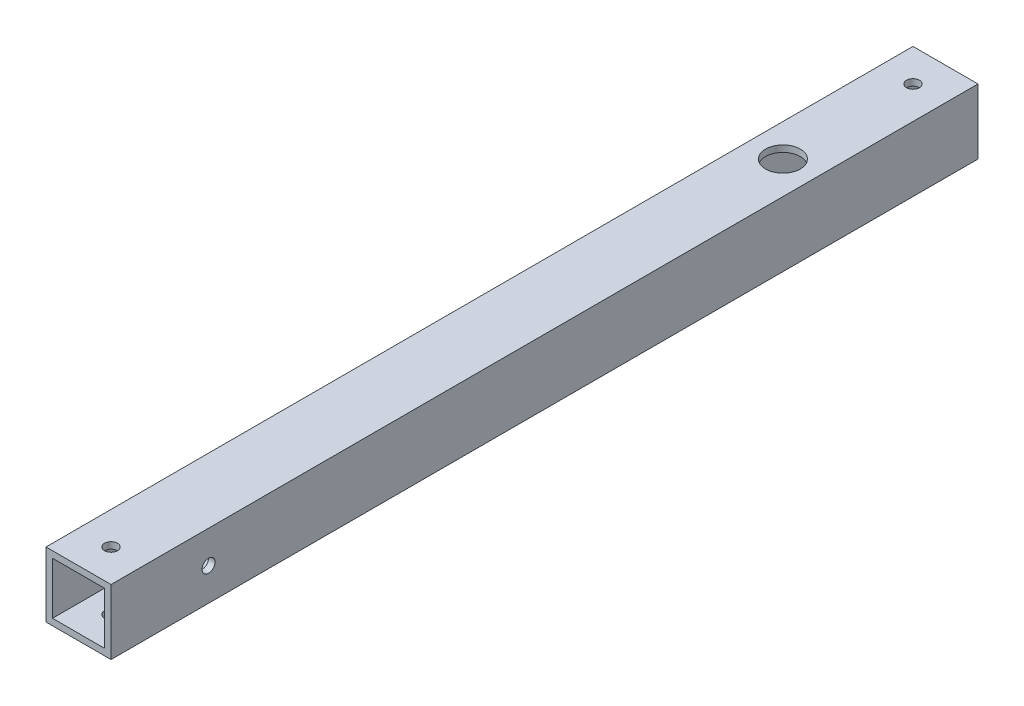
ISO-10303-21;
HEADER;
FILE_DESCRIPTION(('STEP AP214'),'2;1');
FILE_NAME('part.step','',(''),(''),'','','');
FILE_SCHEMA(('AUTOMOTIVE_DESIGN { 1 0 10303 214 1 1 1 1 }'));
ENDSEC;
DATA;
#1=APPLICATION_CONTEXT('core data for automotive mechanical design processes');
#2=APPLICATION_PROTOCOL_DEFINITION('international standard','automotive_design',2000,#1);
#3=PRODUCT_CONTEXT('',#1,'mechanical');
#4=PRODUCT('Part','Part','',(#3));
#5=PRODUCT_RELATED_PRODUCT_CATEGORY('part','',(#4));
#6=PRODUCT_DEFINITION_FORMATION('','',#4);
#7=PRODUCT_DEFINITION_CONTEXT('part definition',#1,'design');
#8=PRODUCT_DEFINITION('design','',#6,#7);
#9=PRODUCT_DEFINITION_SHAPE('','',#8);
#10=(LENGTH_UNIT() NAMED_UNIT(*) SI_UNIT(.MILLI.,.METRE.));
#11=(NAMED_UNIT(*) PLANE_ANGLE_UNIT() SI_UNIT($,.RADIAN.));
#12=(NAMED_UNIT(*) SI_UNIT($,.STERADIAN.) SOLID_ANGLE_UNIT());
#13=UNCERTAINTY_MEASURE_WITH_UNIT(LENGTH_MEASURE(1.E-05),#10,'distance_accuracy_value','');
#14=(GEOMETRIC_REPRESENTATION_CONTEXT(3) GLOBAL_UNCERTAINTY_ASSIGNED_CONTEXT((#13)) GLOBAL_UNIT_ASSIGNED_CONTEXT((#10,
#11,#12)) REPRESENTATION_CONTEXT('',''));
#15=CARTESIAN_POINT('',(0.,0.,0.));
#16=DIRECTION('',(0.,0.,1.));
#17=DIRECTION('',(1.,0.,0.));
#18=AXIS2_PLACEMENT_3D('',#15,#16,#17);
#19=CARTESIAN_POINT('',(0.,0.,200.));
#20=DIRECTION('',(0.,0.,1.));
#21=DIRECTION('',(1.,0.,0.));
#22=AXIS2_PLACEMENT_3D('',#19,#20,#21);
#23=PLANE('',#22);
#24=DIRECTION('',(0.,-1.,0.));
#25=VECTOR('',#24,1.);
#26=CARTESIAN_POINT('',(-7.01008414074451,7.73262608579252,200.));
#27=LINE('',#26,#25);
#28=CARTESIAN_POINT('',(-7.01008414074451,7.73262608579252,200.));
#29=VERTEX_POINT('',#28);
#30=CARTESIAN_POINT('',(-7.01008414074451,-7.26737391420748,200.));
#31=VERTEX_POINT('',#30);
#32=EDGE_CURVE('E138',#29,#31,#27,.T.);
#33=ORIENTED_EDGE('',*,*,#32,.T.);
#34=DIRECTION('',(1.,0.,0.));
#35=VECTOR('',#34,1.);
#36=CARTESIAN_POINT('',(-7.01008414074451,-7.26737391420748,200.));
#37=LINE('',#36,#35);
#38=CARTESIAN_POINT('',(7.98991585925548,-7.26737391420748,200.));
#39=VERTEX_POINT('',#38);
#40=EDGE_CURVE('E141',#31,#39,#37,.T.);
#41=ORIENTED_EDGE('',*,*,#40,.T.);
#42=DIRECTION('',(0.,1.,0.));
#43=VECTOR('',#42,1.);
#44=CARTESIAN_POINT('',(7.98991585925549,7.73262608579252,200.));
#45=LINE('',#44,#43);
#46=CARTESIAN_POINT('',(7.98991585925549,7.73262608579252,200.));
#47=VERTEX_POINT('',#46);
#48=EDGE_CURVE('E144',#39,#47,#45,.T.);
#49=ORIENTED_EDGE('',*,*,#48,.T.);
#50=DIRECTION('',(-1.,0.,0.));
#51=VECTOR('',#50,1.);
#52=CARTESIAN_POINT('',(-7.01008414074451,7.73262608579252,200.));
#53=LINE('',#52,#51);
#54=EDGE_CURVE('E146',#47,#29,#53,.T.);
#55=ORIENTED_EDGE('',*,*,#54,.T.);
#56=EDGE_LOOP('',(#33,#41,#49,#55));
#57=FACE_BOUND('',#56,.T.);
#58=DIRECTION('',(1.,0.,0.));
#59=VECTOR('',#58,1.);
#60=CARTESIAN_POINT('',(-5.51008414074451,-5.76737391420748,200.));
#61=LINE('',#60,#59);
#62=CARTESIAN_POINT('',(-5.51008414074451,-5.76737391420748,200.));
#63=VERTEX_POINT('',#62);
#64=CARTESIAN_POINT('',(6.48991585925549,-5.76737391420748,200.));
#65=VERTEX_POINT('',#64);
#66=EDGE_CURVE('E108',#63,#65,#61,.T.);
#67=ORIENTED_EDGE('',*,*,#66,.F.);
#68=DIRECTION('',(0.,-1.,0.));
#69=VECTOR('',#68,1.);
#70=CARTESIAN_POINT('',(-5.51008414074451,6.23262608579252,200.));
#71=LINE('',#70,#69);
#72=CARTESIAN_POINT('',(-5.51008414074451,6.23262608579252,200.));
#73=VERTEX_POINT('',#72);
#74=EDGE_CURVE('E100',#73,#63,#71,.T.);
#75=ORIENTED_EDGE('',*,*,#74,.F.);
#76=DIRECTION('',(-1.,0.,0.));
#77=VECTOR('',#76,1.);
#78=CARTESIAN_POINT('',(-5.51008414074451,6.23262608579252,200.));
#79=LINE('',#78,#77);
#80=CARTESIAN_POINT('',(6.48991585925549,6.23262608579252,200.));
#81=VERTEX_POINT('',#80);
#82=EDGE_CURVE('E122',#81,#73,#79,.T.);
#83=ORIENTED_EDGE('',*,*,#82,.F.);
#84=DIRECTION('',(0.,1.,0.));
#85=VECTOR('',#84,1.);
#86=CARTESIAN_POINT('',(6.48991585925549,6.23262608579252,200.));
#87=LINE('',#86,#85);
#88=EDGE_CURVE('E120',#65,#81,#87,.T.);
#89=ORIENTED_EDGE('',*,*,#88,.F.);
#90=EDGE_LOOP('',(#67,#75,#83,#89));
#91=FACE_BOUND('',#90,.T.);
#92=ADVANCED_FACE('F33',(#57,#91),#23,.T.);
#93=CARTESIAN_POINT('',(0.,0.,0.));
#94=DIRECTION('',(0.,0.,1.));
#95=DIRECTION('',(1.,0.,0.));
#96=AXIS2_PLACEMENT_3D('',#93,#94,#95);
#97=PLANE('',#96);
#98=DIRECTION('',(0.,-1.,0.));
#99=VECTOR('',#98,1.);
#100=CARTESIAN_POINT('',(-7.01008414074451,7.73262608579252,0.));
#101=LINE('',#100,#99);
#102=CARTESIAN_POINT('',(-7.01008414074451,7.73262608579252,0.));
#103=VERTEX_POINT('',#102);
#104=CARTESIAN_POINT('',(-7.01008414074451,-7.26737391420748,0.));
#105=VERTEX_POINT('',#104);
#106=EDGE_CURVE('E116',#103,#105,#101,.T.);
#107=ORIENTED_EDGE('',*,*,#106,.F.);
#108=DIRECTION('',(-1.,0.,0.));
#109=VECTOR('',#108,1.);
#110=CARTESIAN_POINT('',(-7.01008414074451,7.73262608579252,0.));
#111=LINE('',#110,#109);
#112=CARTESIAN_POINT('',(7.98991585925549,7.73262608579252,0.));
#113=VERTEX_POINT('',#112);
#114=EDGE_CURVE('E142',#113,#103,#111,.T.);
#115=ORIENTED_EDGE('',*,*,#114,.F.);
#116=DIRECTION('',(0.,1.,0.));
#117=VECTOR('',#116,1.);
#118=CARTESIAN_POINT('',(7.98991585925549,7.73262608579252,0.));
#119=LINE('',#118,#117);
#120=CARTESIAN_POINT('',(7.98991585925548,-7.26737391420748,0.));
#121=VERTEX_POINT('',#120);
#122=EDGE_CURVE('E153',#121,#113,#119,.T.);
#123=ORIENTED_EDGE('',*,*,#122,.F.);
#124=DIRECTION('',(1.,0.,0.));
#125=VECTOR('',#124,1.);
#126=CARTESIAN_POINT('',(-7.01008414074451,-7.26737391420748,0.));
#127=LINE('',#126,#125);
#128=EDGE_CURVE('E151',#105,#121,#127,.T.);
#129=ORIENTED_EDGE('',*,*,#128,.F.);
#130=EDGE_LOOP('',(#107,#115,#123,#129));
#131=FACE_BOUND('',#130,.T.);
#132=DIRECTION('',(0.,-1.,0.));
#133=VECTOR('',#132,1.);
#134=CARTESIAN_POINT('',(-5.51008414074451,6.23262608579252,0.));
#135=LINE('',#134,#133);
#136=CARTESIAN_POINT('',(-5.51008414074451,6.23262608579252,0.));
#137=VERTEX_POINT('',#136);
#138=CARTESIAN_POINT('',(-5.51008414074451,-5.76737391420748,0.));
#139=VERTEX_POINT('',#138);
#140=EDGE_CURVE('E58',#137,#139,#135,.T.);
#141=ORIENTED_EDGE('',*,*,#140,.T.);
#142=DIRECTION('',(1.,0.,0.));
#143=VECTOR('',#142,1.);
#144=CARTESIAN_POINT('',(-5.51008414074451,-5.76737391420748,0.));
#145=LINE('',#144,#143);
#146=CARTESIAN_POINT('',(6.48991585925549,-5.76737391420748,0.));
#147=VERTEX_POINT('',#146);
#148=EDGE_CURVE('E115',#139,#147,#145,.T.);
#149=ORIENTED_EDGE('',*,*,#148,.T.);
#150=DIRECTION('',(0.,1.,0.));
#151=VECTOR('',#150,1.);
#152=CARTESIAN_POINT('',(6.48991585925549,6.23262608579252,0.));
#153=LINE('',#152,#151);
#154=CARTESIAN_POINT('',(6.48991585925549,6.23262608579252,0.));
#155=VERTEX_POINT('',#154);
#156=EDGE_CURVE('E130',#147,#155,#153,.T.);
#157=ORIENTED_EDGE('',*,*,#156,.T.);
#158=DIRECTION('',(-1.,0.,0.));
#159=VECTOR('',#158,1.);
#160=CARTESIAN_POINT('',(-5.51008414074451,6.23262608579252,0.));
#161=LINE('',#160,#159);
#162=EDGE_CURVE('E109',#155,#137,#161,.T.);
#163=ORIENTED_EDGE('',*,*,#162,.T.);
#164=EDGE_LOOP('',(#141,#149,#157,#163));
#165=FACE_BOUND('',#164,.T.);
#166=ADVANCED_FACE('F231',(#131,#165),#97,.F.);
#167=CARTESIAN_POINT('',(-7.01008414074451,7.73262608579252,200.));
#168=DIRECTION('',(1.,0.,0.));
#169=DIRECTION('',(0.,1.,0.));
#170=AXIS2_PLACEMENT_3D('',#167,#168,#169);
#171=PLANE('',#170);
#172=CARTESIAN_POINT('',(-7.01008414074451,0.232626085792522,177.5));
#173=DIRECTION('',(1.,0.,0.));
#174=DIRECTION('',(0.,1.,0.));
#175=AXIS2_PLACEMENT_3D('',#172,#173,#174);
#176=CIRCLE('',#175,1.5);
#177=CARTESIAN_POINT('',(-7.01008414074451,1.73262608579252,177.5));
#178=VERTEX_POINT('',#177);
#179=EDGE_CURVE('E171',#178,#178,#176,.T.);
#180=ORIENTED_EDGE('',*,*,#179,.T.);
#181=EDGE_LOOP('',(#180));
#182=FACE_BOUND('',#181,.T.);
#183=ORIENTED_EDGE('',*,*,#106,.T.);
#184=DIRECTION('',(0.,0.,-1.));
#185=VECTOR('',#184,1.);
#186=CARTESIAN_POINT('',(-7.01008414074451,-7.26737391420748,200.));
#187=LINE('',#186,#185);
#188=EDGE_CURVE('E11',#31,#105,#187,.T.);
#189=ORIENTED_EDGE('',*,*,#188,.F.);
#190=ORIENTED_EDGE('',*,*,#32,.F.);
#191=DIRECTION('',(0.,0.,-1.));
#192=VECTOR('',#191,1.);
#193=CARTESIAN_POINT('',(-7.01008414074451,7.73262608579252,200.));
#194=LINE('',#193,#192);
#195=EDGE_CURVE('E148',#29,#103,#194,.T.);
#196=ORIENTED_EDGE('',*,*,#195,.T.);
#197=EDGE_LOOP('',(#183,#189,#190,#196));
#198=FACE_BOUND('',#197,.T.);
#199=ADVANCED_FACE('F35',(#182,#198),#171,.F.);
#200=CARTESIAN_POINT('',(-7.01008414074451,-7.26737391420748,200.));
#201=DIRECTION('',(0.,1.,0.));
#202=DIRECTION('',(0.,0.,1.));
#203=AXIS2_PLACEMENT_3D('',#200,#201,#202);
#204=PLANE('',#203);
#205=CARTESIAN_POINT('',(0.489915859255487,-7.26737391420748,37.5));
#206=DIRECTION('',(0.,-1.,0.));
#207=DIRECTION('',(0.,0.,-1.));
#208=AXIS2_PLACEMENT_3D('',#205,#206,#207);
#209=CIRCLE('',#208,1.5);
#210=CARTESIAN_POINT('',(0.489915859255487,-7.26737391420748,36.));
#211=VERTEX_POINT('',#210);
#212=EDGE_CURVE('E181',#211,#211,#209,.T.);
#213=ORIENTED_EDGE('',*,*,#212,.F.);
#214=EDGE_LOOP('',(#213));
#215=FACE_BOUND('',#214,.T.);
#216=CARTESIAN_POINT('',(0.489915859255487,-7.26737391420748,7.5));
#217=DIRECTION('',(0.,-1.,0.));
#218=DIRECTION('',(0.,0.,-1.));
#219=AXIS2_PLACEMENT_3D('',#216,#217,#218);
#220=CIRCLE('',#219,4.);
#221=CARTESIAN_POINT('',(0.489915859255487,-7.26737391420748,3.5));
#222=VERTEX_POINT('',#221);
#223=EDGE_CURVE('E187',#222,#222,#220,.T.);
#224=ORIENTED_EDGE('',*,*,#223,.F.);
#225=EDGE_LOOP('',(#224));
#226=FACE_BOUND('',#225,.T.);
#227=CARTESIAN_POINT('',(0.489915859255487,-7.26737391420748,192.5));
#228=DIRECTION('',(0.,1.,0.));
#229=DIRECTION('',(0.,0.,1.));
#230=AXIS2_PLACEMENT_3D('',#227,#228,#229);
#231=CIRCLE('',#230,1.5);
#232=CARTESIAN_POINT('',(0.489915859255487,-7.26737391420748,194.));
#233=VERTEX_POINT('',#232);
#234=EDGE_CURVE('E166',#233,#233,#231,.T.);
#235=ORIENTED_EDGE('',*,*,#234,.T.);
#236=EDGE_LOOP('',(#235));
#237=FACE_BOUND('',#236,.T.);
#238=ORIENTED_EDGE('',*,*,#128,.T.);
#239=DIRECTION('',(0.,0.,-1.));
#240=VECTOR('',#239,1.);
#241=CARTESIAN_POINT('',(7.98991585925548,-7.26737391420748,200.));
#242=LINE('',#241,#240);
#243=EDGE_CURVE('E42',#39,#121,#242,.T.);
#244=ORIENTED_EDGE('',*,*,#243,.F.);
#245=ORIENTED_EDGE('',*,*,#40,.F.);
#246=ORIENTED_EDGE('',*,*,#188,.T.);
#247=EDGE_LOOP('',(#238,#244,#245,#246));
#248=FACE_BOUND('',#247,.T.);
#249=ADVANCED_FACE('F245',(#215,#226,#237,#248),#204,.F.);
#250=CARTESIAN_POINT('',(7.98991585925549,7.73262608579252,200.));
#251=DIRECTION('',(-1.,0.,0.));
#252=DIRECTION('',(0.,-1.,0.));
#253=AXIS2_PLACEMENT_3D('',#250,#251,#252);
#254=PLANE('',#253);
#255=CARTESIAN_POINT('',(7.98991585925548,0.232626085792518,177.5));
#256=DIRECTION('',(1.,0.,0.));
#257=DIRECTION('',(0.,1.,0.));
#258=AXIS2_PLACEMENT_3D('',#255,#256,#257);
#259=CIRCLE('',#258,1.5);
#260=CARTESIAN_POINT('',(7.98991585925548,1.73262608579252,177.5));
#261=VERTEX_POINT('',#260);
#262=EDGE_CURVE('E178',#261,#261,#259,.T.);
#263=ORIENTED_EDGE('',*,*,#262,.F.);
#264=EDGE_LOOP('',(#263));
#265=FACE_BOUND('',#264,.T.);
#266=ORIENTED_EDGE('',*,*,#122,.T.);
#267=DIRECTION('',(0.,0.,-1.));
#268=VECTOR('',#267,1.);
#269=CARTESIAN_POINT('',(7.98991585925549,7.73262608579252,200.));
#270=LINE('',#269,#268);
#271=EDGE_CURVE('E158',#47,#113,#270,.T.);
#272=ORIENTED_EDGE('',*,*,#271,.F.);
#273=ORIENTED_EDGE('',*,*,#48,.F.);
#274=ORIENTED_EDGE('',*,*,#243,.T.);
#275=EDGE_LOOP('',(#266,#272,#273,#274));
#276=FACE_BOUND('',#275,.T.);
#277=ADVANCED_FACE('F242',(#265,#276),#254,.F.);
#278=CARTESIAN_POINT('',(-7.01008414074451,7.73262608579252,200.));
#279=DIRECTION('',(0.,-1.,0.));
#280=DIRECTION('',(0.,0.,-1.));
#281=AXIS2_PLACEMENT_3D('',#278,#279,#280);
#282=PLANE('',#281);
#283=CARTESIAN_POINT('',(0.489915859255487,7.73262608579252,7.5));
#284=DIRECTION('',(0.,1.,0.));
#285=DIRECTION('',(0.,0.,1.));
#286=AXIS2_PLACEMENT_3D('',#283,#284,#285);
#287=CIRCLE('',#286,1.5);
#288=CARTESIAN_POINT('',(0.489915859255487,7.73262608579252,9.));
#289=VERTEX_POINT('',#288);
#290=EDGE_CURVE('E176',#289,#289,#287,.T.);
#291=ORIENTED_EDGE('',*,*,#290,.F.);
#292=EDGE_LOOP('',(#291));
#293=FACE_BOUND('',#292,.T.);
#294=CARTESIAN_POINT('',(0.489915859255487,7.73262608579252,37.5));
#295=DIRECTION('',(0.,1.,0.));
#296=DIRECTION('',(0.,0.,1.));
#297=AXIS2_PLACEMENT_3D('',#294,#295,#296);
#298=CIRCLE('',#297,4.);
#299=CARTESIAN_POINT('',(0.489915859255487,7.73262608579252,41.5));
#300=VERTEX_POINT('',#299);
#301=EDGE_CURVE('E185',#300,#300,#298,.T.);
#302=ORIENTED_EDGE('',*,*,#301,.F.);
#303=EDGE_LOOP('',(#302));
#304=FACE_BOUND('',#303,.T.);
#305=CARTESIAN_POINT('',(0.489915859255487,7.73262608579252,192.5));
#306=DIRECTION('',(0.,1.,0.));
#307=DIRECTION('',(0.,0.,1.));
#308=AXIS2_PLACEMENT_3D('',#305,#306,#307);
#309=CIRCLE('',#308,1.5);
#310=CARTESIAN_POINT('',(0.489915859255487,7.73262608579252,194.));
#311=VERTEX_POINT('',#310);
#312=EDGE_CURVE('E204',#311,#311,#309,.T.);
#313=ORIENTED_EDGE('',*,*,#312,.F.);
#314=EDGE_LOOP('',(#313));
#315=FACE_BOUND('',#314,.T.);
#316=ORIENTED_EDGE('',*,*,#114,.T.);
#317=ORIENTED_EDGE('',*,*,#195,.F.);
#318=ORIENTED_EDGE('',*,*,#54,.F.);
#319=ORIENTED_EDGE('',*,*,#271,.T.);
#320=EDGE_LOOP('',(#316,#317,#318,#319));
#321=FACE_BOUND('',#320,.T.);
#322=ADVANCED_FACE('F225',(#293,#304,#315,#321),#282,.F.);
#323=CARTESIAN_POINT('',(-5.51008414074451,6.23262608579252,200.));
#324=DIRECTION('',(1.,0.,0.));
#325=DIRECTION('',(0.,1.,0.));
#326=AXIS2_PLACEMENT_3D('',#323,#324,#325);
#327=PLANE('',#326);
#328=CARTESIAN_POINT('',(-5.51008414074451,0.232626085792522,177.5));
#329=DIRECTION('',(1.,0.,0.));
#330=DIRECTION('',(0.,1.,0.));
#331=AXIS2_PLACEMENT_3D('',#328,#329,#330);
#332=CIRCLE('',#331,1.5);
#333=CARTESIAN_POINT('',(-5.51008414074451,1.73262608579252,177.5));
#334=VERTEX_POINT('',#333);
#335=EDGE_CURVE('E170',#334,#334,#332,.T.);
#336=ORIENTED_EDGE('',*,*,#335,.F.);
#337=EDGE_LOOP('',(#336));
#338=FACE_BOUND('',#337,.T.);
#339=ORIENTED_EDGE('',*,*,#140,.F.);
#340=DIRECTION('',(0.,0.,-1.));
#341=VECTOR('',#340,1.);
#342=CARTESIAN_POINT('',(-5.51008414074451,6.23262608579252,200.));
#343=LINE('',#342,#341);
#344=EDGE_CURVE('E104',#73,#137,#343,.T.);
#345=ORIENTED_EDGE('',*,*,#344,.F.);
#346=ORIENTED_EDGE('',*,*,#74,.T.);
#347=DIRECTION('',(0.,0.,-1.));
#348=VECTOR('',#347,1.);
#349=CARTESIAN_POINT('',(-5.51008414074451,-5.76737391420748,200.));
#350=LINE('',#349,#348);
#351=EDGE_CURVE('E103',#63,#139,#350,.T.);
#352=ORIENTED_EDGE('',*,*,#351,.T.);
#353=EDGE_LOOP('',(#339,#345,#346,#352));
#354=FACE_BOUND('',#353,.T.);
#355=ADVANCED_FACE('F102',(#338,#354),#327,.T.);
#356=CARTESIAN_POINT('',(-5.51008414074451,-5.76737391420748,200.));
#357=DIRECTION('',(0.,1.,0.));
#358=DIRECTION('',(0.,0.,1.));
#359=AXIS2_PLACEMENT_3D('',#356,#357,#358);
#360=PLANE('',#359);
#361=CARTESIAN_POINT('',(0.489915859255487,-5.76737391420748,37.5));
#362=DIRECTION('',(0.,1.,0.));
#363=DIRECTION('',(0.,0.,1.));
#364=AXIS2_PLACEMENT_3D('',#361,#362,#363);
#365=CIRCLE('',#364,1.5);
#366=CARTESIAN_POINT('',(0.489915859255487,-5.76737391420748,39.));
#367=VERTEX_POINT('',#366);
#368=EDGE_CURVE('E37',#367,#367,#365,.T.);
#369=ORIENTED_EDGE('',*,*,#368,.F.);
#370=EDGE_LOOP('',(#369));
#371=FACE_BOUND('',#370,.T.);
#372=CARTESIAN_POINT('',(0.489915859255487,-5.76737391420748,7.5));
#373=DIRECTION('',(0.,1.,0.));
#374=DIRECTION('',(0.,0.,1.));
#375=AXIS2_PLACEMENT_3D('',#372,#373,#374);
#376=CIRCLE('',#375,4.);
#377=CARTESIAN_POINT('',(0.489915859255487,-5.76737391420748,11.5));
#378=VERTEX_POINT('',#377);
#379=EDGE_CURVE('E179',#378,#378,#376,.T.);
#380=ORIENTED_EDGE('',*,*,#379,.F.);
#381=EDGE_LOOP('',(#380));
#382=FACE_BOUND('',#381,.T.);
#383=CARTESIAN_POINT('',(0.489915859255487,-5.76737391420748,192.5));
#384=DIRECTION('',(0.,1.,0.));
#385=DIRECTION('',(0.,0.,1.));
#386=AXIS2_PLACEMENT_3D('',#383,#384,#385);
#387=CIRCLE('',#386,1.5);
#388=CARTESIAN_POINT('',(0.489915859255487,-5.76737391420748,194.));
#389=VERTEX_POINT('',#388);
#390=EDGE_CURVE('E128',#389,#389,#387,.T.);
#391=ORIENTED_EDGE('',*,*,#390,.F.);
#392=EDGE_LOOP('',(#391));
#393=FACE_BOUND('',#392,.T.);
#394=ORIENTED_EDGE('',*,*,#148,.F.);
#395=ORIENTED_EDGE('',*,*,#351,.F.);
#396=ORIENTED_EDGE('',*,*,#66,.T.);
#397=DIRECTION('',(0.,0.,-1.));
#398=VECTOR('',#397,1.);
#399=CARTESIAN_POINT('',(6.48991585925549,-5.76737391420748,200.));
#400=LINE('',#399,#398);
#401=EDGE_CURVE('E117',#65,#147,#400,.T.);
#402=ORIENTED_EDGE('',*,*,#401,.T.);
#403=EDGE_LOOP('',(#394,#395,#396,#402));
#404=FACE_BOUND('',#403,.T.);
#405=ADVANCED_FACE('F112',(#371,#382,#393,#404),#360,.T.);
#406=CARTESIAN_POINT('',(6.48991585925549,6.23262608579252,200.));
#407=DIRECTION('',(-1.,0.,0.));
#408=DIRECTION('',(0.,-1.,0.));
#409=AXIS2_PLACEMENT_3D('',#406,#407,#408);
#410=PLANE('',#409);
#411=CARTESIAN_POINT('',(6.48991585925549,0.232626085792519,177.5));
#412=DIRECTION('',(-1.,0.,0.));
#413=DIRECTION('',(0.,-1.,0.));
#414=AXIS2_PLACEMENT_3D('',#411,#412,#413);
#415=CIRCLE('',#414,1.5);
#416=CARTESIAN_POINT('',(6.48991585925549,-1.26737391420748,177.5));
#417=VERTEX_POINT('',#416);
#418=EDGE_CURVE('E167',#417,#417,#415,.T.);
#419=ORIENTED_EDGE('',*,*,#418,.F.);
#420=EDGE_LOOP('',(#419));
#421=FACE_BOUND('',#420,.T.);
#422=ORIENTED_EDGE('',*,*,#156,.F.);
#423=ORIENTED_EDGE('',*,*,#401,.F.);
#424=ORIENTED_EDGE('',*,*,#88,.T.);
#425=DIRECTION('',(0.,0.,-1.));
#426=VECTOR('',#425,1.);
#427=CARTESIAN_POINT('',(6.48991585925549,6.23262608579252,200.));
#428=LINE('',#427,#426);
#429=EDGE_CURVE('E50',#81,#155,#428,.T.);
#430=ORIENTED_EDGE('',*,*,#429,.T.);
#431=EDGE_LOOP('',(#422,#423,#424,#430));
#432=FACE_BOUND('',#431,.T.);
#433=ADVANCED_FACE('F215',(#421,#432),#410,.T.);
#434=CARTESIAN_POINT('',(-5.51008414074451,6.23262608579252,200.));
#435=DIRECTION('',(0.,-1.,0.));
#436=DIRECTION('',(0.,0.,-1.));
#437=AXIS2_PLACEMENT_3D('',#434,#435,#436);
#438=PLANE('',#437);
#439=CARTESIAN_POINT('',(0.489915859255487,6.23262608579252,7.5));
#440=DIRECTION('',(0.,-1.,0.));
#441=DIRECTION('',(0.,0.,-1.));
#442=AXIS2_PLACEMENT_3D('',#439,#440,#441);
#443=CIRCLE('',#442,1.5);
#444=CARTESIAN_POINT('',(0.489915859255487,6.23262608579252,6.));
#445=VERTEX_POINT('',#444);
#446=EDGE_CURVE('E175',#445,#445,#443,.T.);
#447=ORIENTED_EDGE('',*,*,#446,.F.);
#448=EDGE_LOOP('',(#447));
#449=FACE_BOUND('',#448,.T.);
#450=CARTESIAN_POINT('',(0.489915859255487,6.23262608579252,37.5));
#451=DIRECTION('',(0.,-1.,0.));
#452=DIRECTION('',(0.,0.,-1.));
#453=AXIS2_PLACEMENT_3D('',#450,#451,#452);
#454=CIRCLE('',#453,4.);
#455=CARTESIAN_POINT('',(0.489915859255487,6.23262608579252,33.5));
#456=VERTEX_POINT('',#455);
#457=EDGE_CURVE('E172',#456,#456,#454,.T.);
#458=ORIENTED_EDGE('',*,*,#457,.F.);
#459=EDGE_LOOP('',(#458));
#460=FACE_BOUND('',#459,.T.);
#461=CARTESIAN_POINT('',(0.489915859255487,6.23262608579252,192.5));
#462=DIRECTION('',(0.,-1.,0.));
#463=DIRECTION('',(0.,0.,-1.));
#464=AXIS2_PLACEMENT_3D('',#461,#462,#463);
#465=CIRCLE('',#464,1.5);
#466=CARTESIAN_POINT('',(0.489915859255487,6.23262608579252,191.));
#467=VERTEX_POINT('',#466);
#468=EDGE_CURVE('E163',#467,#467,#465,.T.);
#469=ORIENTED_EDGE('',*,*,#468,.F.);
#470=EDGE_LOOP('',(#469));
#471=FACE_BOUND('',#470,.T.);
#472=ORIENTED_EDGE('',*,*,#162,.F.);
#473=ORIENTED_EDGE('',*,*,#429,.F.);
#474=ORIENTED_EDGE('',*,*,#82,.T.);
#475=ORIENTED_EDGE('',*,*,#344,.T.);
#476=EDGE_LOOP('',(#472,#473,#474,#475));
#477=FACE_BOUND('',#476,.T.);
#478=ADVANCED_FACE('F222',(#449,#460,#471,#477),#438,.T.);
#479=CARTESIAN_POINT('',(0.489915859255487,-7.26737391420748,192.5));
#480=DIRECTION('',(0.,1.,0.));
#481=DIRECTION('',(0.,0.,1.));
#482=AXIS2_PLACEMENT_3D('',#479,#480,#481);
#483=CYLINDRICAL_SURFACE('',#482,1.5);
#484=ORIENTED_EDGE('',*,*,#468,.T.);
#485=EDGE_LOOP('',(#484));
#486=FACE_BOUND('',#485,.T.);
#487=ORIENTED_EDGE('',*,*,#312,.T.);
#488=EDGE_LOOP('',(#487));
#489=FACE_BOUND('',#488,.T.);
#490=ADVANCED_FACE('F274',(#486,#489),#483,.F.);
#491=ORIENTED_EDGE('',*,*,#390,.T.);
#492=EDGE_LOOP('',(#491));
#493=FACE_BOUND('',#492,.T.);
#494=ORIENTED_EDGE('',*,*,#234,.F.);
#495=EDGE_LOOP('',(#494));
#496=FACE_BOUND('',#495,.T.);
#497=ADVANCED_FACE('F211',(#493,#496),#483,.F.);
#498=CARTESIAN_POINT('',(-7.01008414074451,0.232626085792522,177.5));
#499=DIRECTION('',(1.,0.,0.));
#500=DIRECTION('',(0.,1.,0.));
#501=AXIS2_PLACEMENT_3D('',#498,#499,#500);
#502=CYLINDRICAL_SURFACE('',#501,1.5);
#503=ORIENTED_EDGE('',*,*,#418,.T.);
#504=EDGE_LOOP('',(#503));
#505=FACE_BOUND('',#504,.T.);
#506=ORIENTED_EDGE('',*,*,#262,.T.);
#507=EDGE_LOOP('',(#506));
#508=FACE_BOUND('',#507,.T.);
#509=ADVANCED_FACE('F285',(#505,#508),#502,.F.);
#510=ORIENTED_EDGE('',*,*,#335,.T.);
#511=EDGE_LOOP('',(#510));
#512=FACE_BOUND('',#511,.T.);
#513=ORIENTED_EDGE('',*,*,#179,.F.);
#514=EDGE_LOOP('',(#513));
#515=FACE_BOUND('',#514,.T.);
#516=ADVANCED_FACE('F288',(#512,#515),#502,.F.);
#517=CARTESIAN_POINT('',(0.489915859255487,-2.26737391420748,37.5));
#518=DIRECTION('',(0.,1.,0.));
#519=DIRECTION('',(0.,0.,1.));
#520=AXIS2_PLACEMENT_3D('',#517,#518,#519);
#521=CYLINDRICAL_SURFACE('',#520,4.);
#522=ORIENTED_EDGE('',*,*,#457,.T.);
#523=EDGE_LOOP('',(#522));
#524=FACE_BOUND('',#523,.T.);
#525=ORIENTED_EDGE('',*,*,#301,.T.);
#526=EDGE_LOOP('',(#525));
#527=FACE_BOUND('',#526,.T.);
#528=ADVANCED_FACE('F290',(#524,#527),#521,.F.);
#529=CARTESIAN_POINT('',(0.489915859255487,-2.26737391420748,7.5));
#530=DIRECTION('',(0.,1.,0.));
#531=DIRECTION('',(0.,0.,1.));
#532=AXIS2_PLACEMENT_3D('',#529,#530,#531);
#533=CYLINDRICAL_SURFACE('',#532,1.5);
#534=ORIENTED_EDGE('',*,*,#446,.T.);
#535=EDGE_LOOP('',(#534));
#536=FACE_BOUND('',#535,.T.);
#537=ORIENTED_EDGE('',*,*,#290,.T.);
#538=EDGE_LOOP('',(#537));
#539=FACE_BOUND('',#538,.T.);
#540=ADVANCED_FACE('F293',(#536,#539),#533,.F.);
#541=CARTESIAN_POINT('',(0.489915859255487,2.73262608579252,7.5));
#542=DIRECTION('',(0.,-1.,0.));
#543=DIRECTION('',(0.,0.,-1.));
#544=AXIS2_PLACEMENT_3D('',#541,#542,#543);
#545=CYLINDRICAL_SURFACE('',#544,4.);
#546=ORIENTED_EDGE('',*,*,#379,.T.);
#547=EDGE_LOOP('',(#546));
#548=FACE_BOUND('',#547,.T.);
#549=ORIENTED_EDGE('',*,*,#223,.T.);
#550=EDGE_LOOP('',(#549));
#551=FACE_BOUND('',#550,.T.);
#552=ADVANCED_FACE('F297',(#548,#551),#545,.F.);
#553=CARTESIAN_POINT('',(0.489915859255487,2.73262608579252,37.5));
#554=DIRECTION('',(0.,-1.,0.));
#555=DIRECTION('',(0.,0.,-1.));
#556=AXIS2_PLACEMENT_3D('',#553,#554,#555);
#557=CYLINDRICAL_SURFACE('',#556,1.5);
#558=ORIENTED_EDGE('',*,*,#368,.T.);
#559=EDGE_LOOP('',(#558));
#560=FACE_BOUND('',#559,.T.);
#561=ORIENTED_EDGE('',*,*,#212,.T.);
#562=EDGE_LOOP('',(#561));
#563=FACE_BOUND('',#562,.T.);
#564=ADVANCED_FACE('F301',(#560,#563),#557,.F.);
#565=CLOSED_SHELL('',(#92,#166,#199,#249,#277,#322,#355,#405,#433,#478,#490,#497,#509,#516,#528,
#540,#552,#564));
#566=MANIFOLD_SOLID_BREP('B2',#565);
#567=ADVANCED_BREP_SHAPE_REPRESENTATION('',(#18,#566),#14);
#568=SHAPE_DEFINITION_REPRESENTATION(#9,#567);
ENDSEC;
END-ISO-10303-21;
